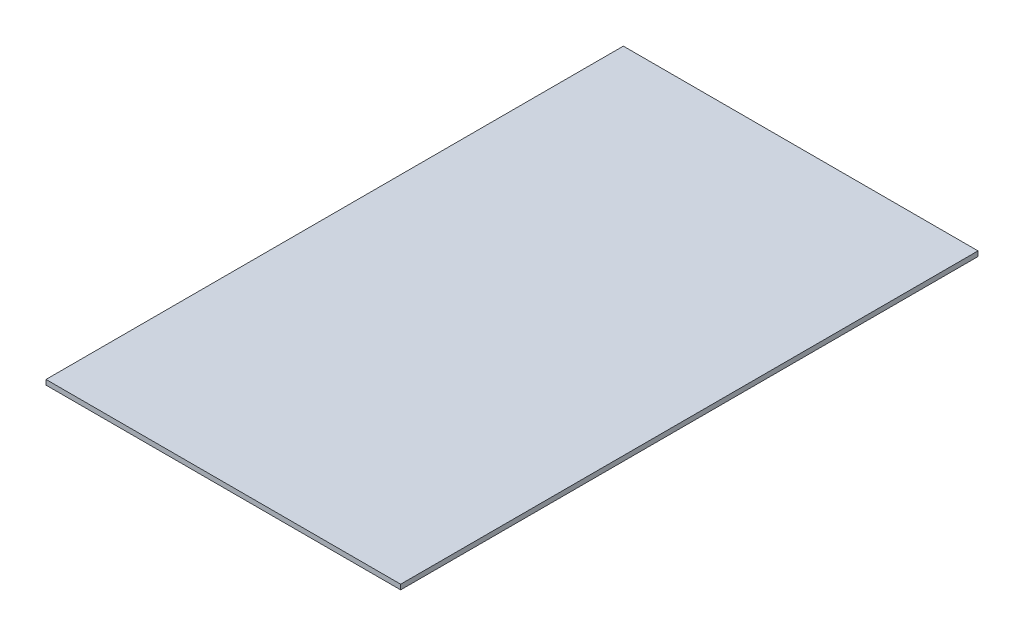
ISO-10303-21;
HEADER;
FILE_DESCRIPTION(('STEP AP214'),'2;1');
FILE_NAME('part.step','',(''),(''),'','','');
FILE_SCHEMA(('AUTOMOTIVE_DESIGN { 1 0 10303 214 1 1 1 1 }'));
ENDSEC;
DATA;
#1=APPLICATION_CONTEXT('core data for automotive mechanical design processes');
#2=APPLICATION_PROTOCOL_DEFINITION('international standard','automotive_design',2000,#1);
#3=PRODUCT_CONTEXT('',#1,'mechanical');
#4=PRODUCT('Part','Part','',(#3));
#5=PRODUCT_RELATED_PRODUCT_CATEGORY('part','',(#4));
#6=PRODUCT_DEFINITION_FORMATION('','',#4);
#7=PRODUCT_DEFINITION_CONTEXT('part definition',#1,'design');
#8=PRODUCT_DEFINITION('design','',#6,#7);
#9=PRODUCT_DEFINITION_SHAPE('','',#8);
#10=(LENGTH_UNIT() NAMED_UNIT(*) SI_UNIT(.MILLI.,.METRE.));
#11=(NAMED_UNIT(*) PLANE_ANGLE_UNIT() SI_UNIT($,.RADIAN.));
#12=(NAMED_UNIT(*) SI_UNIT($,.STERADIAN.) SOLID_ANGLE_UNIT());
#13=UNCERTAINTY_MEASURE_WITH_UNIT(LENGTH_MEASURE(1.E-05),#10,'distance_accuracy_value','');
#14=(GEOMETRIC_REPRESENTATION_CONTEXT(3) GLOBAL_UNCERTAINTY_ASSIGNED_CONTEXT((#13)) GLOBAL_UNIT_ASSIGNED_CONTEXT((#10,
#11,#12)) REPRESENTATION_CONTEXT('',''));
#15=CARTESIAN_POINT('',(0.,0.,0.));
#16=DIRECTION('',(0.,0.,1.));
#17=DIRECTION('',(1.,0.,0.));
#18=AXIS2_PLACEMENT_3D('',#15,#16,#17);
#19=CARTESIAN_POINT('',(-107.5,-13.,227.5));
#20=DIRECTION('',(1.,0.,0.));
#21=DIRECTION('',(0.,1.,0.));
#22=AXIS2_PLACEMENT_3D('',#19,#20,#21);
#23=PLANE('',#22);
#24=DIRECTION('',(0.,0.,-1.));
#25=VECTOR('',#24,1.);
#26=CARTESIAN_POINT('',(-107.5,-9.99999999999998,227.5));
#27=LINE('',#26,#25);
#28=CARTESIAN_POINT('',(-107.5,-9.99999999999998,227.5));
#29=VERTEX_POINT('',#28);
#30=CARTESIAN_POINT('',(-107.5,-9.99999999999998,-122.5));
#31=VERTEX_POINT('',#30);
#32=EDGE_CURVE('E100',#29,#31,#27,.T.);
#33=ORIENTED_EDGE('',*,*,#32,.T.);
#34=DIRECTION('',(0.,1.,0.));
#35=VECTOR('',#34,1.);
#36=CARTESIAN_POINT('',(-107.5,-13.,-122.5));
#37=LINE('',#36,#35);
#38=CARTESIAN_POINT('',(-107.5,-13.,-122.5));
#39=VERTEX_POINT('',#38);
#40=EDGE_CURVE('E11',#39,#31,#37,.T.);
#41=ORIENTED_EDGE('',*,*,#40,.F.);
#42=DIRECTION('',(0.,0.,-1.));
#43=VECTOR('',#42,1.);
#44=CARTESIAN_POINT('',(-107.5,-13.,227.5));
#45=LINE('',#44,#43);
#46=CARTESIAN_POINT('',(-107.5,-13.,227.5));
#47=VERTEX_POINT('',#46);
#48=EDGE_CURVE('E88',#47,#39,#45,.T.);
#49=ORIENTED_EDGE('',*,*,#48,.F.);
#50=DIRECTION('',(0.,1.,0.));
#51=VECTOR('',#50,1.);
#52=CARTESIAN_POINT('',(-107.5,-13.,227.5));
#53=LINE('',#52,#51);
#54=EDGE_CURVE('E96',#47,#29,#53,.T.);
#55=ORIENTED_EDGE('',*,*,#54,.T.);
#56=EDGE_LOOP('',(#33,#41,#49,#55));
#57=FACE_BOUND('',#56,.T.);
#58=ADVANCED_FACE('F37',(#57),#23,.F.);
#59=CARTESIAN_POINT('',(-107.5,-13.,-122.5));
#60=DIRECTION('',(0.,0.,1.));
#61=DIRECTION('',(0.,-1.,0.));
#62=AXIS2_PLACEMENT_3D('',#59,#60,#61);
#63=PLANE('',#62);
#64=DIRECTION('',(1.,0.,0.));
#65=VECTOR('',#64,1.);
#66=CARTESIAN_POINT('',(-107.5,-9.99999999999998,-122.5));
#67=LINE('',#66,#65);
#68=CARTESIAN_POINT('',(107.5,-9.99999999999873,-122.5));
#69=VERTEX_POINT('',#68);
#70=EDGE_CURVE('E92',#31,#69,#67,.T.);
#71=ORIENTED_EDGE('',*,*,#70,.T.);
#72=DIRECTION('',(0.,1.,0.));
#73=VECTOR('',#72,1.);
#74=CARTESIAN_POINT('',(107.5,-12.9999999999987,-122.5));
#75=LINE('',#74,#73);
#76=CARTESIAN_POINT('',(107.5,-12.9999999999987,-122.5));
#77=VERTEX_POINT('',#76);
#78=EDGE_CURVE('E45',#77,#69,#75,.T.);
#79=ORIENTED_EDGE('',*,*,#78,.F.);
#80=DIRECTION('',(1.,0.,0.));
#81=VECTOR('',#80,1.);
#82=CARTESIAN_POINT('',(-107.5,-13.,-122.5));
#83=LINE('',#82,#81);
#84=EDGE_CURVE('E83',#39,#77,#83,.T.);
#85=ORIENTED_EDGE('',*,*,#84,.F.);
#86=ORIENTED_EDGE('',*,*,#40,.T.);
#87=EDGE_LOOP('',(#71,#79,#85,#86));
#88=FACE_BOUND('',#87,.T.);
#89=ADVANCED_FACE('F91',(#88),#63,.F.);
#90=CARTESIAN_POINT('',(107.5,-12.9999999999987,227.5));
#91=DIRECTION('',(-1.,0.,0.));
#92=DIRECTION('',(0.,-1.,0.));
#93=AXIS2_PLACEMENT_3D('',#90,#91,#92);
#94=PLANE('',#93);
#95=DIRECTION('',(0.,0.,1.));
#96=VECTOR('',#95,1.);
#97=CARTESIAN_POINT('',(107.5,-9.99999999999873,227.5));
#98=LINE('',#97,#96);
#99=CARTESIAN_POINT('',(107.5,-9.99999999999873,227.5));
#100=VERTEX_POINT('',#99);
#101=EDGE_CURVE('E70',#69,#100,#98,.T.);
#102=ORIENTED_EDGE('',*,*,#101,.T.);
#103=DIRECTION('',(0.,1.,0.));
#104=VECTOR('',#103,1.);
#105=CARTESIAN_POINT('',(107.5,-12.9999999999987,227.5));
#106=LINE('',#105,#104);
#107=CARTESIAN_POINT('',(107.5,-12.9999999999987,227.5));
#108=VERTEX_POINT('',#107);
#109=EDGE_CURVE('E93',#108,#100,#106,.T.);
#110=ORIENTED_EDGE('',*,*,#109,.F.);
#111=DIRECTION('',(0.,0.,1.));
#112=VECTOR('',#111,1.);
#113=CARTESIAN_POINT('',(107.5,-12.9999999999987,227.5));
#114=LINE('',#113,#112);
#115=EDGE_CURVE('E86',#77,#108,#114,.T.);
#116=ORIENTED_EDGE('',*,*,#115,.F.);
#117=ORIENTED_EDGE('',*,*,#78,.T.);
#118=EDGE_LOOP('',(#102,#110,#116,#117));
#119=FACE_BOUND('',#118,.T.);
#120=ADVANCED_FACE('F94',(#119),#94,.F.);
#121=CARTESIAN_POINT('',(-107.5,-13.,227.5));
#122=DIRECTION('',(0.,0.,-1.));
#123=DIRECTION('',(0.,1.,0.));
#124=AXIS2_PLACEMENT_3D('',#121,#122,#123);
#125=PLANE('',#124);
#126=DIRECTION('',(-1.,0.,0.));
#127=VECTOR('',#126,1.);
#128=CARTESIAN_POINT('',(-107.5,-9.99999999999998,227.5));
#129=LINE('',#128,#127);
#130=EDGE_CURVE('E76',#100,#29,#129,.T.);
#131=ORIENTED_EDGE('',*,*,#130,.T.);
#132=ORIENTED_EDGE('',*,*,#54,.F.);
#133=DIRECTION('',(-1.,0.,0.));
#134=VECTOR('',#133,1.);
#135=CARTESIAN_POINT('',(-107.5,-13.,227.5));
#136=LINE('',#135,#134);
#137=EDGE_CURVE('E53',#108,#47,#136,.T.);
#138=ORIENTED_EDGE('',*,*,#137,.F.);
#139=ORIENTED_EDGE('',*,*,#109,.T.);
#140=EDGE_LOOP('',(#131,#132,#138,#139));
#141=FACE_BOUND('',#140,.T.);
#142=ADVANCED_FACE('F108',(#141),#125,.F.);
#143=CARTESIAN_POINT('',(0.,-12.9999999999994,0.));
#144=DIRECTION('',(0.,-1.,0.));
#145=DIRECTION('',(1.,0.,0.));
#146=AXIS2_PLACEMENT_3D('',#143,#144,#145);
#147=PLANE('',#146);
#148=ORIENTED_EDGE('',*,*,#48,.T.);
#149=ORIENTED_EDGE('',*,*,#84,.T.);
#150=ORIENTED_EDGE('',*,*,#115,.T.);
#151=ORIENTED_EDGE('',*,*,#137,.T.);
#152=EDGE_LOOP('',(#148,#149,#150,#151));
#153=FACE_BOUND('',#152,.T.);
#154=ADVANCED_FACE('F84',(#153),#147,.T.);
#155=CARTESIAN_POINT('',(0.,-9.99999999999936,0.));
#156=DIRECTION('',(0.,-1.,0.));
#157=DIRECTION('',(1.,0.,0.));
#158=AXIS2_PLACEMENT_3D('',#155,#156,#157);
#159=PLANE('',#158);
#160=ORIENTED_EDGE('',*,*,#32,.F.);
#161=ORIENTED_EDGE('',*,*,#130,.F.);
#162=ORIENTED_EDGE('',*,*,#101,.F.);
#163=ORIENTED_EDGE('',*,*,#70,.F.);
#164=EDGE_LOOP('',(#160,#161,#162,#163));
#165=FACE_BOUND('',#164,.T.);
#166=ADVANCED_FACE('F111',(#165),#159,.F.);
#167=CLOSED_SHELL('',(#58,#89,#120,#142,#154,#166));
#168=MANIFOLD_SOLID_BREP('B2',#167);
#169=ADVANCED_BREP_SHAPE_REPRESENTATION('',(#18,#168),#14);
#170=SHAPE_DEFINITION_REPRESENTATION(#9,#169);
ENDSEC;
END-ISO-10303-21;
